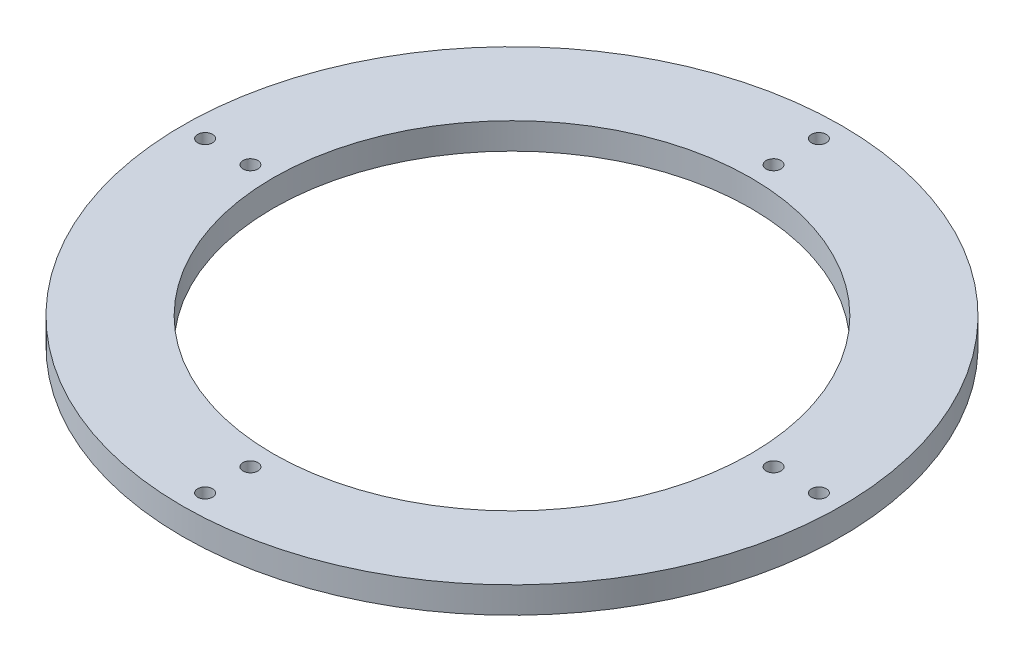
ISO-10303-21;
HEADER;
FILE_DESCRIPTION(('STEP AP214'),'2;1');
FILE_NAME('part.step','',(''),(''),'','','');
FILE_SCHEMA(('AUTOMOTIVE_DESIGN { 1 0 10303 214 1 1 1 1 }'));
ENDSEC;
DATA;
#1=APPLICATION_CONTEXT('core data for automotive mechanical design processes');
#2=APPLICATION_PROTOCOL_DEFINITION('international standard','automotive_design',2000,#1);
#3=PRODUCT_CONTEXT('',#1,'mechanical');
#4=PRODUCT('Part','Part','',(#3));
#5=PRODUCT_RELATED_PRODUCT_CATEGORY('part','',(#4));
#6=PRODUCT_DEFINITION_FORMATION('','',#4);
#7=PRODUCT_DEFINITION_CONTEXT('part definition',#1,'design');
#8=PRODUCT_DEFINITION('design','',#6,#7);
#9=PRODUCT_DEFINITION_SHAPE('','',#8);
#10=(LENGTH_UNIT() NAMED_UNIT(*) SI_UNIT(.MILLI.,.METRE.));
#11=(NAMED_UNIT(*) PLANE_ANGLE_UNIT() SI_UNIT($,.RADIAN.));
#12=(NAMED_UNIT(*) SI_UNIT($,.STERADIAN.) SOLID_ANGLE_UNIT());
#13=UNCERTAINTY_MEASURE_WITH_UNIT(LENGTH_MEASURE(1.E-05),#10,'distance_accuracy_value','');
#14=(GEOMETRIC_REPRESENTATION_CONTEXT(3) GLOBAL_UNCERTAINTY_ASSIGNED_CONTEXT((#13)) GLOBAL_UNIT_ASSIGNED_CONTEXT((#10,
#11,#12)) REPRESENTATION_CONTEXT('',''));
#15=CARTESIAN_POINT('',(0.,0.,0.));
#16=DIRECTION('',(0.,0.,1.));
#17=DIRECTION('',(1.,0.,0.));
#18=AXIS2_PLACEMENT_3D('',#15,#16,#17);
#19=CARTESIAN_POINT('',(0.,8.,0.));
#20=DIRECTION('',(0.,1.,0.));
#21=DIRECTION('',(0.,0.,1.));
#22=AXIS2_PLACEMENT_3D('',#19,#20,#21);
#23=PLANE('',#22);
#24=CARTESIAN_POINT('',(0.,8.,-93.125));
#25=DIRECTION('',(0.,1.,0.));
#26=DIRECTION('',(0.,0.,1.));
#27=AXIS2_PLACEMENT_3D('',#24,#25,#26);
#28=CIRCLE('',#27,2.25);
#29=CARTESIAN_POINT('',(0.,8.,-90.875));
#30=VERTEX_POINT('',#29);
#31=EDGE_CURVE('E60',#30,#30,#28,.T.);
#32=ORIENTED_EDGE('',*,*,#31,.F.);
#33=EDGE_LOOP('',(#32));
#34=FACE_BOUND('',#33,.T.);
#35=CARTESIAN_POINT('',(-79.3749999999986,8.,2.38113047203359E-12));
#36=DIRECTION('',(0.,1.,0.));
#37=DIRECTION('',(0.,0.,1.));
#38=AXIS2_PLACEMENT_3D('',#35,#36,#37);
#39=CIRCLE('',#38,2.25);
#40=CARTESIAN_POINT('',(-79.3749999999986,8.,2.25000000000238));
#41=VERTEX_POINT('',#40);
#42=EDGE_CURVE('E98',#41,#41,#39,.T.);
#43=ORIENTED_EDGE('',*,*,#42,.F.);
#44=EDGE_LOOP('',(#43));
#45=FACE_BOUND('',#44,.T.);
#46=CARTESIAN_POINT('',(3.81107777224795E-12,8.,79.375));
#47=DIRECTION('',(0.,1.,0.));
#48=DIRECTION('',(0.,0.,1.));
#49=AXIS2_PLACEMENT_3D('',#46,#47,#48);
#50=CIRCLE('',#49,2.25);
#51=CARTESIAN_POINT('',(3.81107777224795E-12,8.,81.625));
#52=VERTEX_POINT('',#51);
#53=EDGE_CURVE('E106',#52,#52,#50,.T.);
#54=ORIENTED_EDGE('',*,*,#53,.F.);
#55=EDGE_LOOP('',(#54));
#56=FACE_BOUND('',#55,.T.);
#57=CARTESIAN_POINT('',(79.3750000000014,8.,-2.37140983806536E-12));
#58=DIRECTION('',(0.,1.,0.));
#59=DIRECTION('',(0.,0.,1.));
#60=AXIS2_PLACEMENT_3D('',#57,#58,#59);
#61=CIRCLE('',#60,2.25);
#62=CARTESIAN_POINT('',(79.3750000000014,8.,2.24999999999762));
#63=VERTEX_POINT('',#62);
#64=EDGE_CURVE('E114',#63,#63,#61,.T.);
#65=ORIENTED_EDGE('',*,*,#64,.F.);
#66=EDGE_LOOP('',(#65));
#67=FACE_BOUND('',#66,.T.);
#68=CARTESIAN_POINT('',(-9.31741903882772E-13,8.,-79.375));
#69=DIRECTION('',(0.,1.,0.));
#70=DIRECTION('',(0.,0.,1.));
#71=AXIS2_PLACEMENT_3D('',#68,#69,#70);
#72=CIRCLE('',#71,2.25);
#73=CARTESIAN_POINT('',(-9.31741903882772E-13,8.,-77.125));
#74=VERTEX_POINT('',#73);
#75=EDGE_CURVE('E73',#74,#74,#72,.T.);
#76=ORIENTED_EDGE('',*,*,#75,.F.);
#77=EDGE_LOOP('',(#76));
#78=FACE_BOUND('',#77,.T.);
#79=CARTESIAN_POINT('',(93.1250000000018,8.,-1.79844989364883E-12));
#80=DIRECTION('',(0.,1.,0.));
#81=DIRECTION('',(0.,0.,1.));
#82=AXIS2_PLACEMENT_3D('',#79,#80,#81);
#83=CIRCLE('',#82,2.25000000000001);
#84=CARTESIAN_POINT('',(93.1250000000018,8.,2.24999999999821));
#85=VERTEX_POINT('',#84);
#86=EDGE_CURVE('E64',#85,#85,#83,.T.);
#87=ORIENTED_EDGE('',*,*,#86,.F.);
#88=EDGE_LOOP('',(#87));
#89=FACE_BOUND('',#88,.T.);
#90=CARTESIAN_POINT('',(3.59689978729767E-12,8.,93.125));
#91=DIRECTION('',(0.,1.,0.));
#92=DIRECTION('',(0.,0.,1.));
#93=AXIS2_PLACEMENT_3D('',#90,#91,#92);
#94=CIRCLE('',#93,2.25);
#95=CARTESIAN_POINT('',(3.59689978729767E-12,8.,95.375));
#96=VERTEX_POINT('',#95);
#97=EDGE_CURVE('E91',#96,#96,#94,.T.);
#98=ORIENTED_EDGE('',*,*,#97,.F.);
#99=EDGE_LOOP('',(#98));
#100=FACE_BOUND('',#99,.T.);
#101=CARTESIAN_POINT('',(-93.1249999999982,8.,1.80985441696589E-12));
#102=DIRECTION('',(0.,1.,0.));
#103=DIRECTION('',(0.,0.,1.));
#104=AXIS2_PLACEMENT_3D('',#101,#102,#103);
#105=CIRCLE('',#104,2.25000000000001);
#106=CARTESIAN_POINT('',(-93.1249999999982,8.,2.25000000000182));
#107=VERTEX_POINT('',#106);
#108=EDGE_CURVE('E82',#107,#107,#105,.T.);
#109=ORIENTED_EDGE('',*,*,#108,.F.);
#110=EDGE_LOOP('',(#109));
#111=FACE_BOUND('',#110,.T.);
#112=CARTESIAN_POINT('',(0.,8.,0.));
#113=DIRECTION('',(0.,1.,0.));
#114=DIRECTION('',(0.,0.,1.));
#115=AXIS2_PLACEMENT_3D('',#112,#113,#114);
#116=CIRCLE('',#115,100.);
#117=CARTESIAN_POINT('',(0.,8.,100.));
#118=VERTEX_POINT('',#117);
#119=EDGE_CURVE('E10',#118,#118,#116,.T.);
#120=ORIENTED_EDGE('',*,*,#119,.T.);
#121=EDGE_LOOP('',(#120));
#122=FACE_BOUND('',#121,.T.);
#123=CARTESIAN_POINT('',(0.,8.,0.));
#124=DIRECTION('',(0.,1.,0.));
#125=DIRECTION('',(0.,0.,1.));
#126=AXIS2_PLACEMENT_3D('',#123,#124,#125);
#127=CIRCLE('',#126,72.5);
#128=CARTESIAN_POINT('',(0.,8.,72.5));
#129=VERTEX_POINT('',#128);
#130=EDGE_CURVE('E54',#129,#129,#127,.T.);
#131=ORIENTED_EDGE('',*,*,#130,.F.);
#132=EDGE_LOOP('',(#131));
#133=FACE_BOUND('',#132,.T.);
#134=ADVANCED_FACE('F41',(#34,#45,#56,#67,#78,#89,#100,#111,#122,#133),#23,.T.);
#135=CARTESIAN_POINT('',(0.,0.,0.));
#136=DIRECTION('',(0.,1.,0.));
#137=DIRECTION('',(0.,0.,1.));
#138=AXIS2_PLACEMENT_3D('',#135,#136,#137);
#139=PLANE('',#138);
#140=CARTESIAN_POINT('',(0.,0.,-93.125));
#141=DIRECTION('',(0.,1.,0.));
#142=DIRECTION('',(0.,0.,1.));
#143=AXIS2_PLACEMENT_3D('',#140,#141,#142);
#144=CIRCLE('',#143,2.25);
#145=CARTESIAN_POINT('',(0.,0.,-90.875));
#146=VERTEX_POINT('',#145);
#147=EDGE_CURVE('E81',#146,#146,#144,.T.);
#148=ORIENTED_EDGE('',*,*,#147,.T.);
#149=EDGE_LOOP('',(#148));
#150=FACE_BOUND('',#149,.T.);
#151=CARTESIAN_POINT('',(-79.3749999999986,0.,2.38113047203359E-12));
#152=DIRECTION('',(0.,1.,0.));
#153=DIRECTION('',(0.,0.,1.));
#154=AXIS2_PLACEMENT_3D('',#151,#152,#153);
#155=CIRCLE('',#154,2.25);
#156=CARTESIAN_POINT('',(-79.3749999999986,0.,2.25000000000238));
#157=VERTEX_POINT('',#156);
#158=EDGE_CURVE('E102',#157,#157,#155,.T.);
#159=ORIENTED_EDGE('',*,*,#158,.T.);
#160=EDGE_LOOP('',(#159));
#161=FACE_BOUND('',#160,.T.);
#162=CARTESIAN_POINT('',(3.81107777224795E-12,0.,79.375));
#163=DIRECTION('',(0.,1.,0.));
#164=DIRECTION('',(0.,0.,1.));
#165=AXIS2_PLACEMENT_3D('',#162,#163,#164);
#166=CIRCLE('',#165,2.25);
#167=CARTESIAN_POINT('',(3.81107777224795E-12,0.,81.625));
#168=VERTEX_POINT('',#167);
#169=EDGE_CURVE('E110',#168,#168,#166,.T.);
#170=ORIENTED_EDGE('',*,*,#169,.T.);
#171=EDGE_LOOP('',(#170));
#172=FACE_BOUND('',#171,.T.);
#173=CARTESIAN_POINT('',(79.3750000000014,0.,-2.37140983806536E-12));
#174=DIRECTION('',(0.,1.,0.));
#175=DIRECTION('',(0.,0.,1.));
#176=AXIS2_PLACEMENT_3D('',#173,#174,#175);
#177=CIRCLE('',#176,2.25);
#178=CARTESIAN_POINT('',(79.3750000000014,0.,2.24999999999762));
#179=VERTEX_POINT('',#178);
#180=EDGE_CURVE('E87',#179,#179,#177,.T.);
#181=ORIENTED_EDGE('',*,*,#180,.T.);
#182=EDGE_LOOP('',(#181));
#183=FACE_BOUND('',#182,.T.);
#184=CARTESIAN_POINT('',(-9.31741903882772E-13,0.,-79.375));
#185=DIRECTION('',(0.,1.,0.));
#186=DIRECTION('',(0.,0.,1.));
#187=AXIS2_PLACEMENT_3D('',#184,#185,#186);
#188=CIRCLE('',#187,2.25);
#189=CARTESIAN_POINT('',(-9.31741903882772E-13,0.,-77.125));
#190=VERTEX_POINT('',#189);
#191=EDGE_CURVE('E77',#190,#190,#188,.T.);
#192=ORIENTED_EDGE('',*,*,#191,.T.);
#193=EDGE_LOOP('',(#192));
#194=FACE_BOUND('',#193,.T.);
#195=CARTESIAN_POINT('',(93.1250000000018,0.,-1.79844989364883E-12));
#196=DIRECTION('',(0.,1.,0.));
#197=DIRECTION('',(0.,0.,1.));
#198=AXIS2_PLACEMENT_3D('',#195,#196,#197);
#199=CIRCLE('',#198,2.25000000000001);
#200=CARTESIAN_POINT('',(93.1250000000018,0.,2.24999999999821));
#201=VERTEX_POINT('',#200);
#202=EDGE_CURVE('E68',#201,#201,#199,.T.);
#203=ORIENTED_EDGE('',*,*,#202,.T.);
#204=EDGE_LOOP('',(#203));
#205=FACE_BOUND('',#204,.T.);
#206=CARTESIAN_POINT('',(3.59689978729767E-12,0.,93.125));
#207=DIRECTION('',(0.,1.,0.));
#208=DIRECTION('',(0.,0.,1.));
#209=AXIS2_PLACEMENT_3D('',#206,#207,#208);
#210=CIRCLE('',#209,2.25);
#211=CARTESIAN_POINT('',(3.59689978729767E-12,0.,95.375));
#212=VERTEX_POINT('',#211);
#213=EDGE_CURVE('E69',#212,#212,#210,.T.);
#214=ORIENTED_EDGE('',*,*,#213,.T.);
#215=EDGE_LOOP('',(#214));
#216=FACE_BOUND('',#215,.T.);
#217=CARTESIAN_POINT('',(-93.1249999999982,0.,1.80985441696589E-12));
#218=DIRECTION('',(0.,1.,0.));
#219=DIRECTION('',(0.,0.,1.));
#220=AXIS2_PLACEMENT_3D('',#217,#218,#219);
#221=CIRCLE('',#220,2.25000000000001);
#222=CARTESIAN_POINT('',(-93.1249999999982,0.,2.25000000000182));
#223=VERTEX_POINT('',#222);
#224=EDGE_CURVE('E86',#223,#223,#221,.T.);
#225=ORIENTED_EDGE('',*,*,#224,.T.);
#226=EDGE_LOOP('',(#225));
#227=FACE_BOUND('',#226,.T.);
#228=CARTESIAN_POINT('',(0.,0.,0.));
#229=DIRECTION('',(0.,1.,0.));
#230=DIRECTION('',(0.,0.,1.));
#231=AXIS2_PLACEMENT_3D('',#228,#229,#230);
#232=CIRCLE('',#231,100.);
#233=CARTESIAN_POINT('',(0.,0.,100.));
#234=VERTEX_POINT('',#233);
#235=EDGE_CURVE('E45',#234,#234,#232,.T.);
#236=ORIENTED_EDGE('',*,*,#235,.F.);
#237=EDGE_LOOP('',(#236));
#238=FACE_BOUND('',#237,.T.);
#239=CARTESIAN_POINT('',(0.,0.,0.));
#240=DIRECTION('',(0.,1.,0.));
#241=DIRECTION('',(0.,0.,1.));
#242=AXIS2_PLACEMENT_3D('',#239,#240,#241);
#243=CIRCLE('',#242,72.5);
#244=CARTESIAN_POINT('',(0.,0.,72.5));
#245=VERTEX_POINT('',#244);
#246=EDGE_CURVE('E56',#245,#245,#243,.T.);
#247=ORIENTED_EDGE('',*,*,#246,.T.);
#248=EDGE_LOOP('',(#247));
#249=FACE_BOUND('',#248,.T.);
#250=ADVANCED_FACE('F133',(#150,#161,#172,#183,#194,#205,#216,#227,#238,#249),#139,.F.);
#251=CARTESIAN_POINT('',(0.,8.,0.));
#252=DIRECTION('',(0.,-1.,0.));
#253=DIRECTION('',(0.,0.,-1.));
#254=AXIS2_PLACEMENT_3D('',#251,#252,#253);
#255=CYLINDRICAL_SURFACE('',#254,100.);
#256=ORIENTED_EDGE('',*,*,#119,.F.);
#257=EDGE_LOOP('',(#256));
#258=FACE_BOUND('',#257,.T.);
#259=ORIENTED_EDGE('',*,*,#235,.T.);
#260=EDGE_LOOP('',(#259));
#261=FACE_BOUND('',#260,.T.);
#262=ADVANCED_FACE('F43',(#258,#261),#255,.T.);
#263=CARTESIAN_POINT('',(0.,8.,0.));
#264=DIRECTION('',(0.,-1.,0.));
#265=DIRECTION('',(0.,0.,-1.));
#266=AXIS2_PLACEMENT_3D('',#263,#264,#265);
#267=CYLINDRICAL_SURFACE('',#266,72.5);
#268=ORIENTED_EDGE('',*,*,#130,.T.);
#269=EDGE_LOOP('',(#268));
#270=FACE_BOUND('',#269,.T.);
#271=ORIENTED_EDGE('',*,*,#246,.F.);
#272=EDGE_LOOP('',(#271));
#273=FACE_BOUND('',#272,.T.);
#274=ADVANCED_FACE('F151',(#270,#273),#267,.F.);
#275=CARTESIAN_POINT('',(-93.1249999999982,8.,1.80985441696589E-12));
#276=DIRECTION('',(0.,-1.,0.));
#277=DIRECTION('',(0.,0.,-1.));
#278=AXIS2_PLACEMENT_3D('',#275,#276,#277);
#279=CYLINDRICAL_SURFACE('',#278,2.25000000000001);
#280=ORIENTED_EDGE('',*,*,#108,.T.);
#281=EDGE_LOOP('',(#280));
#282=FACE_BOUND('',#281,.T.);
#283=ORIENTED_EDGE('',*,*,#224,.F.);
#284=EDGE_LOOP('',(#283));
#285=FACE_BOUND('',#284,.T.);
#286=ADVANCED_FACE('F154',(#282,#285),#279,.F.);
#287=CARTESIAN_POINT('',(3.59689978729767E-12,8.,93.125));
#288=DIRECTION('',(0.,-1.,0.));
#289=DIRECTION('',(0.,0.,-1.));
#290=AXIS2_PLACEMENT_3D('',#287,#288,#289);
#291=CYLINDRICAL_SURFACE('',#290,2.25);
#292=ORIENTED_EDGE('',*,*,#97,.T.);
#293=EDGE_LOOP('',(#292));
#294=FACE_BOUND('',#293,.T.);
#295=ORIENTED_EDGE('',*,*,#213,.F.);
#296=EDGE_LOOP('',(#295));
#297=FACE_BOUND('',#296,.T.);
#298=ADVANCED_FACE('F170',(#294,#297),#291,.F.);
#299=CARTESIAN_POINT('',(93.1250000000018,8.,-1.79844989364883E-12));
#300=DIRECTION('',(0.,-1.,0.));
#301=DIRECTION('',(0.,0.,-1.));
#302=AXIS2_PLACEMENT_3D('',#299,#300,#301);
#303=CYLINDRICAL_SURFACE('',#302,2.25000000000001);
#304=ORIENTED_EDGE('',*,*,#86,.T.);
#305=EDGE_LOOP('',(#304));
#306=FACE_BOUND('',#305,.T.);
#307=ORIENTED_EDGE('',*,*,#202,.F.);
#308=EDGE_LOOP('',(#307));
#309=FACE_BOUND('',#308,.T.);
#310=ADVANCED_FACE('F166',(#306,#309),#303,.F.);
#311=CARTESIAN_POINT('',(-9.31741903882772E-13,8.,-79.375));
#312=DIRECTION('',(0.,-1.,0.));
#313=DIRECTION('',(0.,0.,-1.));
#314=AXIS2_PLACEMENT_3D('',#311,#312,#313);
#315=CYLINDRICAL_SURFACE('',#314,2.25);
#316=ORIENTED_EDGE('',*,*,#75,.T.);
#317=EDGE_LOOP('',(#316));
#318=FACE_BOUND('',#317,.T.);
#319=ORIENTED_EDGE('',*,*,#191,.F.);
#320=EDGE_LOOP('',(#319));
#321=FACE_BOUND('',#320,.T.);
#322=ADVANCED_FACE('F169',(#318,#321),#315,.F.);
#323=CARTESIAN_POINT('',(79.3750000000014,8.,-2.37140983806536E-12));
#324=DIRECTION('',(0.,-1.,0.));
#325=DIRECTION('',(0.,0.,-1.));
#326=AXIS2_PLACEMENT_3D('',#323,#324,#325);
#327=CYLINDRICAL_SURFACE('',#326,2.25);
#328=ORIENTED_EDGE('',*,*,#64,.T.);
#329=EDGE_LOOP('',(#328));
#330=FACE_BOUND('',#329,.T.);
#331=ORIENTED_EDGE('',*,*,#180,.F.);
#332=EDGE_LOOP('',(#331));
#333=FACE_BOUND('',#332,.T.);
#334=ADVANCED_FACE('F174',(#330,#333),#327,.F.);
#335=CARTESIAN_POINT('',(3.81107777224795E-12,8.,79.375));
#336=DIRECTION('',(0.,-1.,0.));
#337=DIRECTION('',(0.,0.,-1.));
#338=AXIS2_PLACEMENT_3D('',#335,#336,#337);
#339=CYLINDRICAL_SURFACE('',#338,2.25);
#340=ORIENTED_EDGE('',*,*,#53,.T.);
#341=EDGE_LOOP('',(#340));
#342=FACE_BOUND('',#341,.T.);
#343=ORIENTED_EDGE('',*,*,#169,.F.);
#344=EDGE_LOOP('',(#343));
#345=FACE_BOUND('',#344,.T.);
#346=ADVANCED_FACE('F185',(#342,#345),#339,.F.);
#347=CARTESIAN_POINT('',(-79.3749999999986,8.,2.38113047203359E-12));
#348=DIRECTION('',(0.,-1.,0.));
#349=DIRECTION('',(0.,0.,-1.));
#350=AXIS2_PLACEMENT_3D('',#347,#348,#349);
#351=CYLINDRICAL_SURFACE('',#350,2.25);
#352=ORIENTED_EDGE('',*,*,#42,.T.);
#353=EDGE_LOOP('',(#352));
#354=FACE_BOUND('',#353,.T.);
#355=ORIENTED_EDGE('',*,*,#158,.F.);
#356=EDGE_LOOP('',(#355));
#357=FACE_BOUND('',#356,.T.);
#358=ADVANCED_FACE('F182',(#354,#357),#351,.F.);
#359=CARTESIAN_POINT('',(0.,8.,-93.125));
#360=DIRECTION('',(0.,-1.,0.));
#361=DIRECTION('',(0.,0.,-1.));
#362=AXIS2_PLACEMENT_3D('',#359,#360,#361);
#363=CYLINDRICAL_SURFACE('',#362,2.25);
#364=ORIENTED_EDGE('',*,*,#31,.T.);
#365=EDGE_LOOP('',(#364));
#366=FACE_BOUND('',#365,.T.);
#367=ORIENTED_EDGE('',*,*,#147,.F.);
#368=EDGE_LOOP('',(#367));
#369=FACE_BOUND('',#368,.T.);
#370=ADVANCED_FACE('F128',(#366,#369),#363,.F.);
#371=CLOSED_SHELL('',(#134,#250,#262,#274,#286,#298,#310,#322,#334,#346,#358,#370));
#372=MANIFOLD_SOLID_BREP('B2',#371);
#373=ADVANCED_BREP_SHAPE_REPRESENTATION('',(#18,#372),#14);
#374=SHAPE_DEFINITION_REPRESENTATION(#9,#373);
ENDSEC;
END-ISO-10303-21;
